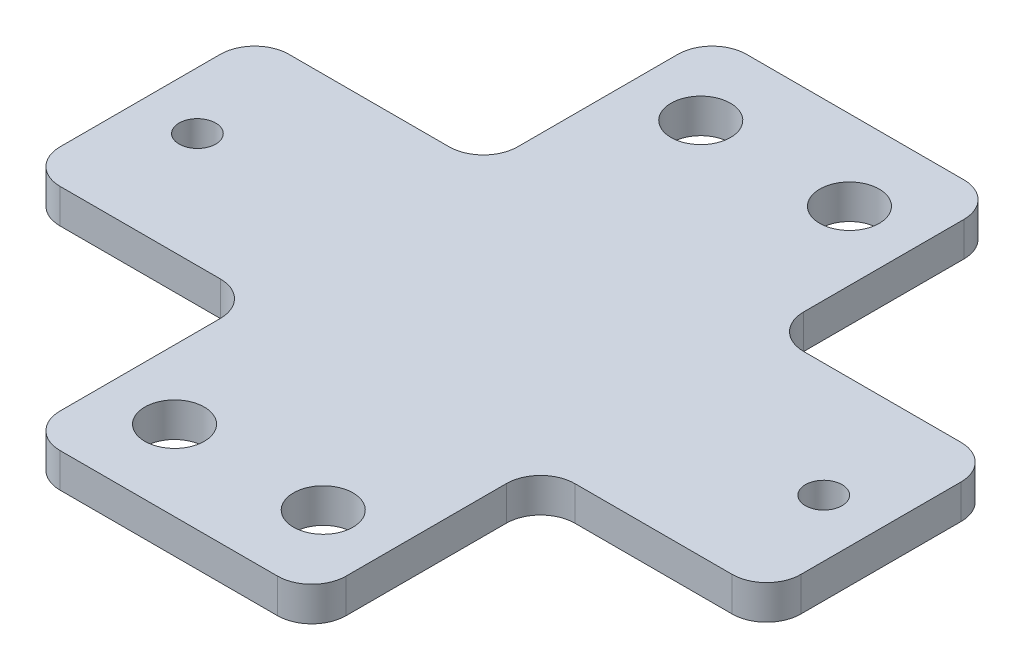
ISO-10303-21;
HEADER;
FILE_DESCRIPTION(('STEP AP214'),'2;1');
FILE_NAME('part.step','',(''),(''),'','','');
FILE_SCHEMA(('AUTOMOTIVE_DESIGN { 1 0 10303 214 1 1 1 1 }'));
ENDSEC;
DATA;
#1=APPLICATION_CONTEXT('core data for automotive mechanical design processes');
#2=APPLICATION_PROTOCOL_DEFINITION('international standard','automotive_design',2000,#1);
#3=PRODUCT_CONTEXT('',#1,'mechanical');
#4=PRODUCT('Part','Part','',(#3));
#5=PRODUCT_RELATED_PRODUCT_CATEGORY('part','',(#4));
#6=PRODUCT_DEFINITION_FORMATION('','',#4);
#7=PRODUCT_DEFINITION_CONTEXT('part definition',#1,'design');
#8=PRODUCT_DEFINITION('design','',#6,#7);
#9=PRODUCT_DEFINITION_SHAPE('','',#8);
#10=(LENGTH_UNIT() NAMED_UNIT(*) SI_UNIT(.MILLI.,.METRE.));
#11=(NAMED_UNIT(*) PLANE_ANGLE_UNIT() SI_UNIT($,.RADIAN.));
#12=(NAMED_UNIT(*) SI_UNIT($,.STERADIAN.) SOLID_ANGLE_UNIT());
#13=UNCERTAINTY_MEASURE_WITH_UNIT(LENGTH_MEASURE(1.E-05),#10,'distance_accuracy_value','');
#14=(GEOMETRIC_REPRESENTATION_CONTEXT(3) GLOBAL_UNCERTAINTY_ASSIGNED_CONTEXT((#13)) GLOBAL_UNIT_ASSIGNED_CONTEXT((#10,
#11,#12)) REPRESENTATION_CONTEXT('',''));
#15=CARTESIAN_POINT('',(0.,0.,0.));
#16=DIRECTION('',(0.,0.,1.));
#17=DIRECTION('',(1.,0.,0.));
#18=AXIS2_PLACEMENT_3D('',#15,#16,#17);
#19=CARTESIAN_POINT('',(25.,3.,0.));
#20=DIRECTION('',(-1.,0.,0.));
#21=DIRECTION('',(0.,0.,1.));
#22=AXIS2_PLACEMENT_3D('',#19,#20,#21);
#23=PLANE('',#22);
#24=DIRECTION('',(0.,0.,-1.));
#25=VECTOR('',#24,1.);
#26=CARTESIAN_POINT('',(25.,3.,0.));
#27=LINE('',#26,#25);
#28=CARTESIAN_POINT('',(25.,3.,-43.));
#29=VERTEX_POINT('',#28);
#30=CARTESIAN_POINT('',(25.,3.,-57.));
#31=VERTEX_POINT('',#30);
#32=EDGE_CURVE('E396',#29,#31,#27,.T.);
#33=ORIENTED_EDGE('',*,*,#32,.F.);
#34=DIRECTION('',(0.,1.,0.));
#35=VECTOR('',#34,1.);
#36=CARTESIAN_POINT('',(25.,3.,-43.));
#37=LINE('',#36,#35);
#38=CARTESIAN_POINT('',(25.,0.,-43.));
#39=VERTEX_POINT('',#38);
#40=EDGE_CURVE('E281',#29,#39,#37,.F.);
#41=ORIENTED_EDGE('',*,*,#40,.T.);
#42=DIRECTION('',(0.,0.,-1.));
#43=VECTOR('',#42,1.);
#44=CARTESIAN_POINT('',(25.,0.,0.));
#45=LINE('',#44,#43);
#46=CARTESIAN_POINT('',(25.,0.,-57.));
#47=VERTEX_POINT('',#46);
#48=EDGE_CURVE('E226',#39,#47,#45,.T.);
#49=ORIENTED_EDGE('',*,*,#48,.T.);
#50=DIRECTION('',(0.,-1.,0.));
#51=VECTOR('',#50,1.);
#52=CARTESIAN_POINT('',(25.,3.,-57.));
#53=LINE('',#52,#51);
#54=EDGE_CURVE('E279',#47,#31,#53,.F.);
#55=ORIENTED_EDGE('',*,*,#54,.T.);
#56=EDGE_LOOP('',(#33,#41,#49,#55));
#57=FACE_BOUND('',#56,.T.);
#58=ADVANCED_FACE('F34',(#57),#23,.F.);
#59=CARTESIAN_POINT('',(0.,3.,0.));
#60=DIRECTION('',(1.,0.,0.));
#61=DIRECTION('',(0.,0.,-1.));
#62=AXIS2_PLACEMENT_3D('',#59,#60,#61);
#63=PLANE('',#62);
#64=DIRECTION('',(0.,0.,1.));
#65=VECTOR('',#64,1.);
#66=CARTESIAN_POINT('',(0.,3.,0.));
#67=LINE('',#66,#65);
#68=CARTESIAN_POINT('',(0.,3.,-17.));
#69=VERTEX_POINT('',#68);
#70=CARTESIAN_POINT('',(0.,3.,-3.));
#71=VERTEX_POINT('',#70);
#72=EDGE_CURVE('E229',#69,#71,#67,.T.);
#73=ORIENTED_EDGE('',*,*,#72,.F.);
#74=DIRECTION('',(0.,1.,0.));
#75=VECTOR('',#74,1.);
#76=CARTESIAN_POINT('',(0.,3.,-17.));
#77=LINE('',#76,#75);
#78=CARTESIAN_POINT('',(0.,0.,-17.));
#79=VERTEX_POINT('',#78);
#80=EDGE_CURVE('E310',#69,#79,#77,.F.);
#81=ORIENTED_EDGE('',*,*,#80,.T.);
#82=DIRECTION('',(0.,0.,1.));
#83=VECTOR('',#82,1.);
#84=CARTESIAN_POINT('',(0.,0.,0.));
#85=LINE('',#84,#83);
#86=CARTESIAN_POINT('',(0.,0.,-3.));
#87=VERTEX_POINT('',#86);
#88=EDGE_CURVE('E352',#79,#87,#85,.T.);
#89=ORIENTED_EDGE('',*,*,#88,.T.);
#90=DIRECTION('',(0.,-1.,0.));
#91=VECTOR('',#90,1.);
#92=CARTESIAN_POINT('',(0.,3.,-3.));
#93=LINE('',#92,#91);
#94=EDGE_CURVE('E308',#87,#71,#93,.F.);
#95=ORIENTED_EDGE('',*,*,#94,.T.);
#96=EDGE_LOOP('',(#73,#81,#89,#95));
#97=FACE_BOUND('',#96,.T.);
#98=ADVANCED_FACE('F340',(#97),#63,.F.);
#99=CARTESIAN_POINT('',(0.,3.,0.));
#100=DIRECTION('',(0.,-1.,0.));
#101=DIRECTION('',(0.,0.,-1.));
#102=AXIS2_PLACEMENT_3D('',#99,#100,#101);
#103=PLANE('',#102);
#104=DIRECTION('',(1.,0.,0.));
#105=VECTOR('',#104,1.);
#106=CARTESIAN_POINT('',(25.,3.,-20.));
#107=LINE('',#106,#105);
#108=CARTESIAN_POINT('',(28.,3.,-20.));
#109=VERTEX_POINT('',#108);
#110=CARTESIAN_POINT('',(41.75,3.,-20.));
#111=VERTEX_POINT('',#110);
#112=EDGE_CURVE('E412',#109,#111,#107,.T.);
#113=ORIENTED_EDGE('',*,*,#112,.T.);
#114=CARTESIAN_POINT('',(41.75,3.,-23.));
#115=DIRECTION('',(0.,-1.,0.));
#116=DIRECTION('',(0.,0.,-1.));
#117=AXIS2_PLACEMENT_3D('',#114,#115,#116);
#118=CIRCLE('',#117,3.);
#119=CARTESIAN_POINT('',(44.75,3.,-23.));
#120=VERTEX_POINT('',#119);
#121=EDGE_CURVE('E256',#111,#120,#118,.F.);
#122=ORIENTED_EDGE('',*,*,#121,.T.);
#123=DIRECTION('',(0.,0.,-1.));
#124=VECTOR('',#123,1.);
#125=CARTESIAN_POINT('',(44.75,3.,-40.));
#126=LINE('',#125,#124);
#127=CARTESIAN_POINT('',(44.75,3.,-37.));
#128=VERTEX_POINT('',#127);
#129=EDGE_CURVE('E419',#120,#128,#126,.T.);
#130=ORIENTED_EDGE('',*,*,#129,.T.);
#131=CARTESIAN_POINT('',(41.75,3.,-37.));
#132=DIRECTION('',(0.,-1.,0.));
#133=DIRECTION('',(0.,0.,-1.));
#134=AXIS2_PLACEMENT_3D('',#131,#132,#133);
#135=CIRCLE('',#134,3.);
#136=CARTESIAN_POINT('',(41.75,3.,-40.));
#137=VERTEX_POINT('',#136);
#138=EDGE_CURVE('E254',#128,#137,#135,.F.);
#139=ORIENTED_EDGE('',*,*,#138,.T.);
#140=DIRECTION('',(-1.,0.,0.));
#141=VECTOR('',#140,1.);
#142=CARTESIAN_POINT('',(25.,3.,-40.));
#143=LINE('',#142,#141);
#144=CARTESIAN_POINT('',(28.,3.,-40.));
#145=VERTEX_POINT('',#144);
#146=EDGE_CURVE('E363',#137,#145,#143,.T.);
#147=ORIENTED_EDGE('',*,*,#146,.T.);
#148=CARTESIAN_POINT('',(28.,3.,-43.));
#149=DIRECTION('',(0.,-1.,0.));
#150=DIRECTION('',(0.,0.,-1.));
#151=AXIS2_PLACEMENT_3D('',#148,#149,#150);
#152=CIRCLE('',#151,3.);
#153=EDGE_CURVE('E319',#145,#29,#152,.T.);
#154=ORIENTED_EDGE('',*,*,#153,.T.);
#155=ORIENTED_EDGE('',*,*,#32,.T.);
#156=CARTESIAN_POINT('',(22.,3.,-57.));
#157=DIRECTION('',(0.,-1.,0.));
#158=DIRECTION('',(0.,0.,-1.));
#159=AXIS2_PLACEMENT_3D('',#156,#157,#158);
#160=CIRCLE('',#159,3.);
#161=CARTESIAN_POINT('',(22.,3.,-60.));
#162=VERTEX_POINT('',#161);
#163=EDGE_CURVE('E252',#31,#162,#160,.F.);
#164=ORIENTED_EDGE('',*,*,#163,.T.);
#165=DIRECTION('',(-1.,0.,0.));
#166=VECTOR('',#165,1.);
#167=CARTESIAN_POINT('',(0.,3.,-60.));
#168=LINE('',#167,#166);
#169=CARTESIAN_POINT('',(3.,3.,-60.));
#170=VERTEX_POINT('',#169);
#171=EDGE_CURVE('E217',#162,#170,#168,.T.);
#172=ORIENTED_EDGE('',*,*,#171,.T.);
#173=CARTESIAN_POINT('',(3.,3.,-57.));
#174=DIRECTION('',(0.,-1.,0.));
#175=DIRECTION('',(0.,0.,-1.));
#176=AXIS2_PLACEMENT_3D('',#173,#174,#175);
#177=CIRCLE('',#176,3.);
#178=CARTESIAN_POINT('',(0.,3.,-57.));
#179=VERTEX_POINT('',#178);
#180=EDGE_CURVE('E250',#170,#179,#177,.F.);
#181=ORIENTED_EDGE('',*,*,#180,.T.);
#182=CARTESIAN_POINT('',(0.,3.,-43.));
#183=VERTEX_POINT('',#182);
#184=EDGE_CURVE('E344',#179,#183,#67,.T.);
#185=ORIENTED_EDGE('',*,*,#184,.T.);
#186=CARTESIAN_POINT('',(-3.,3.,-43.));
#187=DIRECTION('',(0.,-1.,0.));
#188=DIRECTION('',(0.,0.,-1.));
#189=AXIS2_PLACEMENT_3D('',#186,#187,#188);
#190=CIRCLE('',#189,3.);
#191=CARTESIAN_POINT('',(-3.,3.,-40.));
#192=VERTEX_POINT('',#191);
#193=EDGE_CURVE('E323',#183,#192,#190,.T.);
#194=ORIENTED_EDGE('',*,*,#193,.T.);
#195=DIRECTION('',(-1.,0.,0.));
#196=VECTOR('',#195,1.);
#197=CARTESIAN_POINT('',(0.,3.,-40.));
#198=LINE('',#197,#196);
#199=CARTESIAN_POINT('',(-17.,3.,-40.));
#200=VERTEX_POINT('',#199);
#201=EDGE_CURVE('E503',#192,#200,#198,.T.);
#202=ORIENTED_EDGE('',*,*,#201,.T.);
#203=CARTESIAN_POINT('',(-17.,3.,-37.));
#204=DIRECTION('',(0.,-1.,0.));
#205=DIRECTION('',(0.,0.,-1.));
#206=AXIS2_PLACEMENT_3D('',#203,#204,#205);
#207=CIRCLE('',#206,3.);
#208=CARTESIAN_POINT('',(-20.,3.,-37.));
#209=VERTEX_POINT('',#208);
#210=EDGE_CURVE('E248',#200,#209,#207,.F.);
#211=ORIENTED_EDGE('',*,*,#210,.T.);
#212=DIRECTION('',(0.,0.,1.));
#213=VECTOR('',#212,1.);
#214=CARTESIAN_POINT('',(-20.,3.,-40.));
#215=LINE('',#214,#213);
#216=CARTESIAN_POINT('',(-20.,3.,-23.));
#217=VERTEX_POINT('',#216);
#218=EDGE_CURVE('E500',#209,#217,#215,.T.);
#219=ORIENTED_EDGE('',*,*,#218,.T.);
#220=CARTESIAN_POINT('',(-17.,3.,-23.));
#221=DIRECTION('',(0.,-1.,0.));
#222=DIRECTION('',(0.,0.,-1.));
#223=AXIS2_PLACEMENT_3D('',#220,#221,#222);
#224=CIRCLE('',#223,3.);
#225=CARTESIAN_POINT('',(-17.,3.,-20.));
#226=VERTEX_POINT('',#225);
#227=EDGE_CURVE('E246',#217,#226,#224,.F.);
#228=ORIENTED_EDGE('',*,*,#227,.T.);
#229=DIRECTION('',(1.,0.,0.));
#230=VECTOR('',#229,1.);
#231=CARTESIAN_POINT('',(0.,3.,-20.));
#232=LINE('',#231,#230);
#233=CARTESIAN_POINT('',(-3.,3.,-20.));
#234=VERTEX_POINT('',#233);
#235=EDGE_CURVE('E335',#226,#234,#232,.T.);
#236=ORIENTED_EDGE('',*,*,#235,.T.);
#237=CARTESIAN_POINT('',(-3.,3.,-17.));
#238=DIRECTION('',(0.,-1.,0.));
#239=DIRECTION('',(0.,0.,-1.));
#240=AXIS2_PLACEMENT_3D('',#237,#238,#239);
#241=CIRCLE('',#240,3.);
#242=EDGE_CURVE('E42',#234,#69,#241,.T.);
#243=ORIENTED_EDGE('',*,*,#242,.T.);
#244=ORIENTED_EDGE('',*,*,#72,.T.);
#245=CARTESIAN_POINT('',(3.,3.,-3.));
#246=DIRECTION('',(0.,-1.,0.));
#247=DIRECTION('',(0.,0.,-1.));
#248=AXIS2_PLACEMENT_3D('',#245,#246,#247);
#249=CIRCLE('',#248,3.);
#250=CARTESIAN_POINT('',(3.,3.,0.));
#251=VERTEX_POINT('',#250);
#252=EDGE_CURVE('E244',#71,#251,#249,.F.);
#253=ORIENTED_EDGE('',*,*,#252,.T.);
#254=DIRECTION('',(1.,0.,0.));
#255=VECTOR('',#254,1.);
#256=CARTESIAN_POINT('',(0.,3.,0.));
#257=LINE('',#256,#255);
#258=CARTESIAN_POINT('',(22.,3.,0.));
#259=VERTEX_POINT('',#258);
#260=EDGE_CURVE('E393',#251,#259,#257,.T.);
#261=ORIENTED_EDGE('',*,*,#260,.T.);
#262=CARTESIAN_POINT('',(22.,3.,-3.));
#263=DIRECTION('',(0.,-1.,0.));
#264=DIRECTION('',(0.,0.,-1.));
#265=AXIS2_PLACEMENT_3D('',#262,#263,#264);
#266=CIRCLE('',#265,3.);
#267=CARTESIAN_POINT('',(25.,3.,-3.));
#268=VERTEX_POINT('',#267);
#269=EDGE_CURVE('E242',#259,#268,#266,.F.);
#270=ORIENTED_EDGE('',*,*,#269,.T.);
#271=CARTESIAN_POINT('',(25.,3.,-17.));
#272=VERTEX_POINT('',#271);
#273=EDGE_CURVE('E215',#268,#272,#27,.T.);
#274=ORIENTED_EDGE('',*,*,#273,.T.);
#275=CARTESIAN_POINT('',(28.,3.,-17.));
#276=DIRECTION('',(0.,-1.,0.));
#277=DIRECTION('',(0.,0.,-1.));
#278=AXIS2_PLACEMENT_3D('',#275,#276,#277);
#279=CIRCLE('',#278,3.);
#280=EDGE_CURVE('E316',#272,#109,#279,.T.);
#281=ORIENTED_EDGE('',*,*,#280,.T.);
#282=EDGE_LOOP('',(#113,#122,#130,#139,#147,#154,#155,#164,#172,#181,#185,#194,#202,#211,#219,
#228,#236,#243,#244,#253,#261,#270,#274,#281));
#283=FACE_BOUND('',#282,.T.);
#284=CARTESIAN_POINT('',(6.,3.,-7.));
#285=DIRECTION('',(0.,1.,0.));
#286=DIRECTION('',(0.,0.,1.));
#287=AXIS2_PLACEMENT_3D('',#284,#285,#286);
#288=CIRCLE('',#287,2.6);
#289=CARTESIAN_POINT('',(6.,3.,-4.4));
#290=VERTEX_POINT('',#289);
#291=EDGE_CURVE('E388',#290,#290,#288,.T.);
#292=ORIENTED_EDGE('',*,*,#291,.F.);
#293=EDGE_LOOP('',(#292));
#294=FACE_BOUND('',#293,.T.);
#295=CARTESIAN_POINT('',(19.,3.,-7.));
#296=DIRECTION('',(0.,1.,0.));
#297=DIRECTION('',(0.,0.,-1.));
#298=AXIS2_PLACEMENT_3D('',#295,#296,#297);
#299=CIRCLE('',#298,2.6);
#300=CARTESIAN_POINT('',(19.,3.,-9.6));
#301=VERTEX_POINT('',#300);
#302=EDGE_CURVE('E382',#301,#301,#299,.T.);
#303=ORIENTED_EDGE('',*,*,#302,.F.);
#304=EDGE_LOOP('',(#303));
#305=FACE_BOUND('',#304,.T.);
#306=CARTESIAN_POINT('',(6.,3.,-53.));
#307=DIRECTION('',(0.,1.,0.));
#308=DIRECTION('',(0.,0.,-1.));
#309=AXIS2_PLACEMENT_3D('',#306,#307,#308);
#310=CIRCLE('',#309,2.6);
#311=CARTESIAN_POINT('',(6.,3.,-55.6));
#312=VERTEX_POINT('',#311);
#313=EDGE_CURVE('E376',#312,#312,#310,.T.);
#314=ORIENTED_EDGE('',*,*,#313,.F.);
#315=EDGE_LOOP('',(#314));
#316=FACE_BOUND('',#315,.T.);
#317=CARTESIAN_POINT('',(19.,3.,-53.));
#318=DIRECTION('',(0.,1.,0.));
#319=DIRECTION('',(0.,0.,1.));
#320=AXIS2_PLACEMENT_3D('',#317,#318,#319);
#321=CIRCLE('',#320,2.6);
#322=CARTESIAN_POINT('',(19.,3.,-50.4));
#323=VERTEX_POINT('',#322);
#324=EDGE_CURVE('E368',#323,#323,#321,.T.);
#325=ORIENTED_EDGE('',*,*,#324,.F.);
#326=EDGE_LOOP('',(#325));
#327=FACE_BOUND('',#326,.T.);
#328=CARTESIAN_POINT('',(-15.,3.,-30.));
#329=DIRECTION('',(0.,1.,0.));
#330=DIRECTION('',(0.,0.,1.));
#331=AXIS2_PLACEMENT_3D('',#328,#329,#330);
#332=CIRCLE('',#331,1.6);
#333=CARTESIAN_POINT('',(-15.,3.,-28.4));
#334=VERTEX_POINT('',#333);
#335=EDGE_CURVE('E506',#334,#334,#332,.T.);
#336=ORIENTED_EDGE('',*,*,#335,.F.);
#337=EDGE_LOOP('',(#336));
#338=FACE_BOUND('',#337,.T.);
#339=CARTESIAN_POINT('',(39.75,3.,-30.));
#340=DIRECTION('',(0.,1.,0.));
#341=DIRECTION('',(0.,0.,-1.));
#342=AXIS2_PLACEMENT_3D('',#339,#340,#341);
#343=CIRCLE('',#342,1.6);
#344=CARTESIAN_POINT('',(39.75,3.,-31.6));
#345=VERTEX_POINT('',#344);
#346=EDGE_CURVE('E420',#345,#345,#343,.T.);
#347=ORIENTED_EDGE('',*,*,#346,.F.);
#348=EDGE_LOOP('',(#347));
#349=FACE_BOUND('',#348,.T.);
#350=ADVANCED_FACE('F331',(#283,#294,#305,#316,#327,#338,#349),#103,.F.);
#351=CARTESIAN_POINT('',(0.,0.,0.));
#352=DIRECTION('',(0.,-1.,0.));
#353=DIRECTION('',(0.,0.,-1.));
#354=AXIS2_PLACEMENT_3D('',#351,#352,#353);
#355=PLANE('',#354);
#356=CARTESIAN_POINT('',(6.,0.,-53.));
#357=DIRECTION('',(0.,1.,0.));
#358=DIRECTION('',(0.,0.,-1.));
#359=AXIS2_PLACEMENT_3D('',#356,#357,#358);
#360=CIRCLE('',#359,2.6);
#361=CARTESIAN_POINT('',(6.,0.,-55.6));
#362=VERTEX_POINT('',#361);
#363=EDGE_CURVE('E371',#362,#362,#360,.T.);
#364=ORIENTED_EDGE('',*,*,#363,.T.);
#365=EDGE_LOOP('',(#364));
#366=FACE_BOUND('',#365,.T.);
#367=CARTESIAN_POINT('',(6.,0.,-7.));
#368=DIRECTION('',(0.,1.,0.));
#369=DIRECTION('',(0.,0.,1.));
#370=AXIS2_PLACEMENT_3D('',#367,#368,#369);
#371=CIRCLE('',#370,2.6);
#372=CARTESIAN_POINT('',(6.,0.,-4.4));
#373=VERTEX_POINT('',#372);
#374=EDGE_CURVE('E385',#373,#373,#371,.T.);
#375=ORIENTED_EDGE('',*,*,#374,.T.);
#376=EDGE_LOOP('',(#375));
#377=FACE_BOUND('',#376,.T.);
#378=DIRECTION('',(0.,0.,-1.));
#379=VECTOR('',#378,1.);
#380=CARTESIAN_POINT('',(44.75,0.,-40.));
#381=LINE('',#380,#379);
#382=CARTESIAN_POINT('',(44.75,0.,-23.));
#383=VERTEX_POINT('',#382);
#384=CARTESIAN_POINT('',(44.75,0.,-37.));
#385=VERTEX_POINT('',#384);
#386=EDGE_CURVE('E492',#383,#385,#381,.T.);
#387=ORIENTED_EDGE('',*,*,#386,.F.);
#388=CARTESIAN_POINT('',(41.75,0.,-23.));
#389=DIRECTION('',(0.,-1.,0.));
#390=DIRECTION('',(0.,0.,-1.));
#391=AXIS2_PLACEMENT_3D('',#388,#389,#390);
#392=CIRCLE('',#391,3.);
#393=CARTESIAN_POINT('',(41.75,0.,-20.));
#394=VERTEX_POINT('',#393);
#395=EDGE_CURVE('E272',#383,#394,#392,.T.);
#396=ORIENTED_EDGE('',*,*,#395,.T.);
#397=DIRECTION('',(1.,0.,0.));
#398=VECTOR('',#397,1.);
#399=CARTESIAN_POINT('',(25.,0.,-20.));
#400=LINE('',#399,#398);
#401=CARTESIAN_POINT('',(28.,0.,-20.));
#402=VERTEX_POINT('',#401);
#403=EDGE_CURVE('E495',#402,#394,#400,.T.);
#404=ORIENTED_EDGE('',*,*,#403,.F.);
#405=CARTESIAN_POINT('',(28.,0.,-17.));
#406=DIRECTION('',(0.,-1.,0.));
#407=DIRECTION('',(0.,0.,-1.));
#408=AXIS2_PLACEMENT_3D('',#405,#406,#407);
#409=CIRCLE('',#408,3.);
#410=CARTESIAN_POINT('',(25.,0.,-17.));
#411=VERTEX_POINT('',#410);
#412=EDGE_CURVE('E224',#402,#411,#409,.F.);
#413=ORIENTED_EDGE('',*,*,#412,.T.);
#414=CARTESIAN_POINT('',(25.,0.,-3.));
#415=VERTEX_POINT('',#414);
#416=EDGE_CURVE('E212',#415,#411,#45,.T.);
#417=ORIENTED_EDGE('',*,*,#416,.F.);
#418=CARTESIAN_POINT('',(22.,0.,-3.));
#419=DIRECTION('',(0.,-1.,0.));
#420=DIRECTION('',(0.,0.,-1.));
#421=AXIS2_PLACEMENT_3D('',#418,#419,#420);
#422=CIRCLE('',#421,3.);
#423=CARTESIAN_POINT('',(22.,0.,0.));
#424=VERTEX_POINT('',#423);
#425=EDGE_CURVE('E196',#415,#424,#422,.T.);
#426=ORIENTED_EDGE('',*,*,#425,.T.);
#427=DIRECTION('',(1.,0.,0.));
#428=VECTOR('',#427,1.);
#429=CARTESIAN_POINT('',(0.,0.,0.));
#430=LINE('',#429,#428);
#431=CARTESIAN_POINT('',(3.,0.,0.));
#432=VERTEX_POINT('',#431);
#433=EDGE_CURVE('E232',#432,#424,#430,.T.);
#434=ORIENTED_EDGE('',*,*,#433,.F.);
#435=CARTESIAN_POINT('',(3.,0.,-3.));
#436=DIRECTION('',(0.,-1.,0.));
#437=DIRECTION('',(0.,0.,-1.));
#438=AXIS2_PLACEMENT_3D('',#435,#436,#437);
#439=CIRCLE('',#438,3.);
#440=EDGE_CURVE('E204',#432,#87,#439,.T.);
#441=ORIENTED_EDGE('',*,*,#440,.T.);
#442=ORIENTED_EDGE('',*,*,#88,.F.);
#443=CARTESIAN_POINT('',(-3.,0.,-17.));
#444=DIRECTION('',(0.,-1.,0.));
#445=DIRECTION('',(0.,0.,-1.));
#446=AXIS2_PLACEMENT_3D('',#443,#444,#445);
#447=CIRCLE('',#446,3.);
#448=CARTESIAN_POINT('',(-3.,0.,-20.));
#449=VERTEX_POINT('',#448);
#450=EDGE_CURVE('E11',#79,#449,#447,.F.);
#451=ORIENTED_EDGE('',*,*,#450,.T.);
#452=DIRECTION('',(1.,0.,0.));
#453=VECTOR('',#452,1.);
#454=CARTESIAN_POINT('',(0.,0.,-20.));
#455=LINE('',#454,#453);
#456=CARTESIAN_POINT('',(-17.,0.,-20.));
#457=VERTEX_POINT('',#456);
#458=EDGE_CURVE('E350',#457,#449,#455,.T.);
#459=ORIENTED_EDGE('',*,*,#458,.F.);
#460=CARTESIAN_POINT('',(-17.,0.,-23.));
#461=DIRECTION('',(0.,-1.,0.));
#462=DIRECTION('',(0.,0.,-1.));
#463=AXIS2_PLACEMENT_3D('',#460,#461,#462);
#464=CIRCLE('',#463,3.);
#465=CARTESIAN_POINT('',(-20.,0.,-23.));
#466=VERTEX_POINT('',#465);
#467=EDGE_CURVE('E263',#457,#466,#464,.T.);
#468=ORIENTED_EDGE('',*,*,#467,.T.);
#469=DIRECTION('',(0.,0.,1.));
#470=VECTOR('',#469,1.);
#471=CARTESIAN_POINT('',(-20.,0.,-40.));
#472=LINE('',#471,#470);
#473=CARTESIAN_POINT('',(-20.,0.,-37.));
#474=VERTEX_POINT('',#473);
#475=EDGE_CURVE('E356',#474,#466,#472,.T.);
#476=ORIENTED_EDGE('',*,*,#475,.F.);
#477=CARTESIAN_POINT('',(-17.,0.,-37.));
#478=DIRECTION('',(0.,-1.,0.));
#479=DIRECTION('',(0.,0.,-1.));
#480=AXIS2_PLACEMENT_3D('',#477,#478,#479);
#481=CIRCLE('',#480,3.);
#482=CARTESIAN_POINT('',(-17.,0.,-40.));
#483=VERTEX_POINT('',#482);
#484=EDGE_CURVE('E49',#474,#483,#481,.T.);
#485=ORIENTED_EDGE('',*,*,#484,.T.);
#486=DIRECTION('',(-1.,0.,0.));
#487=VECTOR('',#486,1.);
#488=CARTESIAN_POINT('',(0.,0.,-40.));
#489=LINE('',#488,#487);
#490=CARTESIAN_POINT('',(-3.,0.,-40.));
#491=VERTEX_POINT('',#490);
#492=EDGE_CURVE('E360',#491,#483,#489,.T.);
#493=ORIENTED_EDGE('',*,*,#492,.F.);
#494=CARTESIAN_POINT('',(-3.,0.,-43.));
#495=DIRECTION('',(0.,-1.,0.));
#496=DIRECTION('',(0.,0.,-1.));
#497=AXIS2_PLACEMENT_3D('',#494,#495,#496);
#498=CIRCLE('',#497,3.);
#499=CARTESIAN_POINT('',(0.,0.,-43.));
#500=VERTEX_POINT('',#499);
#501=EDGE_CURVE('E325',#491,#500,#498,.F.);
#502=ORIENTED_EDGE('',*,*,#501,.T.);
#503=CARTESIAN_POINT('',(0.,0.,-57.));
#504=VERTEX_POINT('',#503);
#505=EDGE_CURVE('E400',#504,#500,#85,.T.);
#506=ORIENTED_EDGE('',*,*,#505,.F.);
#507=CARTESIAN_POINT('',(3.,0.,-57.));
#508=DIRECTION('',(0.,-1.,0.));
#509=DIRECTION('',(0.,0.,-1.));
#510=AXIS2_PLACEMENT_3D('',#507,#508,#509);
#511=CIRCLE('',#510,3.);
#512=CARTESIAN_POINT('',(3.,0.,-60.));
#513=VERTEX_POINT('',#512);
#514=EDGE_CURVE('E266',#504,#513,#511,.T.);
#515=ORIENTED_EDGE('',*,*,#514,.T.);
#516=DIRECTION('',(-1.,0.,0.));
#517=VECTOR('',#516,1.);
#518=CARTESIAN_POINT('',(0.,0.,-60.));
#519=LINE('',#518,#517);
#520=CARTESIAN_POINT('',(22.,0.,-60.));
#521=VERTEX_POINT('',#520);
#522=EDGE_CURVE('E225',#521,#513,#519,.T.);
#523=ORIENTED_EDGE('',*,*,#522,.F.);
#524=CARTESIAN_POINT('',(22.,0.,-57.));
#525=DIRECTION('',(0.,-1.,0.));
#526=DIRECTION('',(0.,0.,-1.));
#527=AXIS2_PLACEMENT_3D('',#524,#525,#526);
#528=CIRCLE('',#527,3.);
#529=EDGE_CURVE('E268',#521,#47,#528,.T.);
#530=ORIENTED_EDGE('',*,*,#529,.T.);
#531=ORIENTED_EDGE('',*,*,#48,.F.);
#532=CARTESIAN_POINT('',(28.,0.,-43.));
#533=DIRECTION('',(0.,-1.,0.));
#534=DIRECTION('',(0.,0.,-1.));
#535=AXIS2_PLACEMENT_3D('',#532,#533,#534);
#536=CIRCLE('',#535,3.);
#537=CARTESIAN_POINT('',(28.,0.,-40.));
#538=VERTEX_POINT('',#537);
#539=EDGE_CURVE('E321',#39,#538,#536,.F.);
#540=ORIENTED_EDGE('',*,*,#539,.T.);
#541=DIRECTION('',(-1.,0.,0.));
#542=VECTOR('',#541,1.);
#543=CARTESIAN_POINT('',(25.,0.,-40.));
#544=LINE('',#543,#542);
#545=CARTESIAN_POINT('',(41.75,0.,-40.));
#546=VERTEX_POINT('',#545);
#547=EDGE_CURVE('E485',#546,#538,#544,.T.);
#548=ORIENTED_EDGE('',*,*,#547,.F.);
#549=CARTESIAN_POINT('',(41.75,0.,-37.));
#550=DIRECTION('',(0.,-1.,0.));
#551=DIRECTION('',(0.,0.,-1.));
#552=AXIS2_PLACEMENT_3D('',#549,#550,#551);
#553=CIRCLE('',#552,3.);
#554=EDGE_CURVE('E270',#546,#385,#553,.T.);
#555=ORIENTED_EDGE('',*,*,#554,.T.);
#556=EDGE_LOOP('',(#387,#396,#404,#413,#417,#426,#434,#441,#442,#451,#459,#468,#476,#485,#493,
#502,#506,#515,#523,#530,#531,#540,#548,#555));
#557=FACE_BOUND('',#556,.T.);
#558=CARTESIAN_POINT('',(19.,0.,-7.));
#559=DIRECTION('',(0.,1.,0.));
#560=DIRECTION('',(0.,0.,-1.));
#561=AXIS2_PLACEMENT_3D('',#558,#559,#560);
#562=CIRCLE('',#561,2.6);
#563=CARTESIAN_POINT('',(19.,0.,-9.6));
#564=VERTEX_POINT('',#563);
#565=EDGE_CURVE('E379',#564,#564,#562,.T.);
#566=ORIENTED_EDGE('',*,*,#565,.T.);
#567=EDGE_LOOP('',(#566));
#568=FACE_BOUND('',#567,.T.);
#569=CARTESIAN_POINT('',(19.,0.,-53.));
#570=DIRECTION('',(0.,1.,0.));
#571=DIRECTION('',(0.,0.,1.));
#572=AXIS2_PLACEMENT_3D('',#569,#570,#571);
#573=CIRCLE('',#572,2.6);
#574=CARTESIAN_POINT('',(19.,0.,-50.4));
#575=VERTEX_POINT('',#574);
#576=EDGE_CURVE('E372',#575,#575,#573,.T.);
#577=ORIENTED_EDGE('',*,*,#576,.T.);
#578=EDGE_LOOP('',(#577));
#579=FACE_BOUND('',#578,.T.);
#580=CARTESIAN_POINT('',(-15.,0.,-30.));
#581=DIRECTION('',(0.,-1.,0.));
#582=DIRECTION('',(0.,0.,-1.));
#583=AXIS2_PLACEMENT_3D('',#580,#581,#582);
#584=CIRCLE('',#583,1.6);
#585=CARTESIAN_POINT('',(-15.,0.,-31.6));
#586=VERTEX_POINT('',#585);
#587=EDGE_CURVE('E375',#586,#586,#584,.F.);
#588=ORIENTED_EDGE('',*,*,#587,.T.);
#589=EDGE_LOOP('',(#588));
#590=FACE_BOUND('',#589,.T.);
#591=CARTESIAN_POINT('',(39.75,0.,-30.));
#592=DIRECTION('',(0.,-1.,0.));
#593=DIRECTION('',(0.,0.,-1.));
#594=AXIS2_PLACEMENT_3D('',#591,#592,#593);
#595=CIRCLE('',#594,1.6);
#596=CARTESIAN_POINT('',(39.75,0.,-31.6));
#597=VERTEX_POINT('',#596);
#598=EDGE_CURVE('E357',#597,#597,#595,.F.);
#599=ORIENTED_EDGE('',*,*,#598,.T.);
#600=EDGE_LOOP('',(#599));
#601=FACE_BOUND('',#600,.T.);
#602=ADVANCED_FACE('F220',(#366,#377,#557,#568,#579,#590,#601),#355,.T.);
#603=ORIENTED_EDGE('',*,*,#184,.F.);
#604=DIRECTION('',(0.,-1.,0.));
#605=VECTOR('',#604,1.);
#606=CARTESIAN_POINT('',(0.,3.,-57.));
#607=LINE('',#606,#605);
#608=EDGE_CURVE('E291',#179,#504,#607,.T.);
#609=ORIENTED_EDGE('',*,*,#608,.T.);
#610=ORIENTED_EDGE('',*,*,#505,.T.);
#611=DIRECTION('',(0.,1.,0.));
#612=VECTOR('',#611,1.);
#613=CARTESIAN_POINT('',(0.,3.,-43.));
#614=LINE('',#613,#612);
#615=EDGE_CURVE('E288',#500,#183,#614,.T.);
#616=ORIENTED_EDGE('',*,*,#615,.T.);
#617=EDGE_LOOP('',(#603,#609,#610,#616));
#618=FACE_BOUND('',#617,.T.);
#619=ADVANCED_FACE('F443',(#618),#63,.F.);
#620=CARTESIAN_POINT('',(0.,3.,0.));
#621=DIRECTION('',(0.,0.,-1.));
#622=DIRECTION('',(-1.,0.,0.));
#623=AXIS2_PLACEMENT_3D('',#620,#621,#622);
#624=PLANE('',#623);
#625=ORIENTED_EDGE('',*,*,#260,.F.);
#626=DIRECTION('',(0.,-1.,0.));
#627=VECTOR('',#626,1.);
#628=CARTESIAN_POINT('',(3.,3.,0.));
#629=LINE('',#628,#627);
#630=EDGE_CURVE('E313',#251,#432,#629,.T.);
#631=ORIENTED_EDGE('',*,*,#630,.T.);
#632=ORIENTED_EDGE('',*,*,#433,.T.);
#633=DIRECTION('',(0.,-1.,0.));
#634=VECTOR('',#633,1.);
#635=CARTESIAN_POINT('',(22.,3.,0.));
#636=LINE('',#635,#634);
#637=EDGE_CURVE('E200',#424,#259,#636,.F.);
#638=ORIENTED_EDGE('',*,*,#637,.T.);
#639=EDGE_LOOP('',(#625,#631,#632,#638));
#640=FACE_BOUND('',#639,.T.);
#641=ADVANCED_FACE('F407',(#640),#624,.F.);
#642=ORIENTED_EDGE('',*,*,#416,.T.);
#643=DIRECTION('',(0.,1.,0.));
#644=VECTOR('',#643,1.);
#645=CARTESIAN_POINT('',(25.,3.,-17.));
#646=LINE('',#645,#644);
#647=EDGE_CURVE('E216',#411,#272,#646,.T.);
#648=ORIENTED_EDGE('',*,*,#647,.T.);
#649=ORIENTED_EDGE('',*,*,#273,.F.);
#650=DIRECTION('',(0.,-1.,0.));
#651=VECTOR('',#650,1.);
#652=CARTESIAN_POINT('',(25.,3.,-3.));
#653=LINE('',#652,#651);
#654=EDGE_CURVE('E199',#268,#415,#653,.T.);
#655=ORIENTED_EDGE('',*,*,#654,.T.);
#656=EDGE_LOOP('',(#642,#648,#649,#655));
#657=FACE_BOUND('',#656,.T.);
#658=ADVANCED_FACE('F210',(#657),#23,.F.);
#659=CARTESIAN_POINT('',(0.,3.,-60.));
#660=DIRECTION('',(0.,0.,1.));
#661=DIRECTION('',(1.,0.,0.));
#662=AXIS2_PLACEMENT_3D('',#659,#660,#661);
#663=PLANE('',#662);
#664=ORIENTED_EDGE('',*,*,#171,.F.);
#665=DIRECTION('',(0.,-1.,0.));
#666=VECTOR('',#665,1.);
#667=CARTESIAN_POINT('',(22.,3.,-60.));
#668=LINE('',#667,#666);
#669=EDGE_CURVE('E285',#162,#521,#668,.T.);
#670=ORIENTED_EDGE('',*,*,#669,.T.);
#671=ORIENTED_EDGE('',*,*,#522,.T.);
#672=DIRECTION('',(0.,-1.,0.));
#673=VECTOR('',#672,1.);
#674=CARTESIAN_POINT('',(3.,3.,-60.));
#675=LINE('',#674,#673);
#676=EDGE_CURVE('E283',#513,#170,#675,.F.);
#677=ORIENTED_EDGE('',*,*,#676,.T.);
#678=EDGE_LOOP('',(#664,#670,#671,#677));
#679=FACE_BOUND('',#678,.T.);
#680=ADVANCED_FACE('F448',(#679),#663,.F.);
#681=CARTESIAN_POINT('',(6.,3.,-7.));
#682=DIRECTION('',(0.,-1.,0.));
#683=DIRECTION('',(0.,0.,-1.));
#684=AXIS2_PLACEMENT_3D('',#681,#682,#683);
#685=CYLINDRICAL_SURFACE('',#684,2.6);
#686=ORIENTED_EDGE('',*,*,#291,.T.);
#687=EDGE_LOOP('',(#686));
#688=FACE_BOUND('',#687,.T.);
#689=ORIENTED_EDGE('',*,*,#374,.F.);
#690=EDGE_LOOP('',(#689));
#691=FACE_BOUND('',#690,.T.);
#692=ADVANCED_FACE('F453',(#688,#691),#685,.F.);
#693=CARTESIAN_POINT('',(19.,3.,-7.));
#694=DIRECTION('',(0.,-1.,0.));
#695=DIRECTION('',(0.,0.,-1.));
#696=AXIS2_PLACEMENT_3D('',#693,#694,#695);
#697=CYLINDRICAL_SURFACE('',#696,2.6);
#698=ORIENTED_EDGE('',*,*,#302,.T.);
#699=EDGE_LOOP('',(#698));
#700=FACE_BOUND('',#699,.T.);
#701=ORIENTED_EDGE('',*,*,#565,.F.);
#702=EDGE_LOOP('',(#701));
#703=FACE_BOUND('',#702,.T.);
#704=ADVANCED_FACE('F536',(#700,#703),#697,.F.);
#705=CARTESIAN_POINT('',(6.,3.,-53.));
#706=DIRECTION('',(0.,-1.,0.));
#707=DIRECTION('',(0.,0.,-1.));
#708=AXIS2_PLACEMENT_3D('',#705,#706,#707);
#709=CYLINDRICAL_SURFACE('',#708,2.6);
#710=ORIENTED_EDGE('',*,*,#313,.T.);
#711=EDGE_LOOP('',(#710));
#712=FACE_BOUND('',#711,.T.);
#713=ORIENTED_EDGE('',*,*,#363,.F.);
#714=EDGE_LOOP('',(#713));
#715=FACE_BOUND('',#714,.T.);
#716=ADVANCED_FACE('F532',(#712,#715),#709,.F.);
#717=CARTESIAN_POINT('',(19.,3.,-53.));
#718=DIRECTION('',(0.,-1.,0.));
#719=DIRECTION('',(0.,0.,-1.));
#720=AXIS2_PLACEMENT_3D('',#717,#718,#719);
#721=CYLINDRICAL_SURFACE('',#720,2.6);
#722=ORIENTED_EDGE('',*,*,#324,.T.);
#723=EDGE_LOOP('',(#722));
#724=FACE_BOUND('',#723,.T.);
#725=ORIENTED_EDGE('',*,*,#576,.F.);
#726=EDGE_LOOP('',(#725));
#727=FACE_BOUND('',#726,.T.);
#728=ADVANCED_FACE('F529',(#724,#727),#721,.F.);
#729=CARTESIAN_POINT('',(0.,-28.2842712474619,-20.));
#730=DIRECTION('',(0.,0.,1.));
#731=DIRECTION('',(1.,0.,0.));
#732=AXIS2_PLACEMENT_3D('',#729,#730,#731);
#733=PLANE('',#732);
#734=ORIENTED_EDGE('',*,*,#235,.F.);
#735=DIRECTION('',(0.,1.,0.));
#736=VECTOR('',#735,1.);
#737=CARTESIAN_POINT('',(-17.,-28.2842712474619,-20.));
#738=LINE('',#737,#736);
#739=EDGE_CURVE('E306',#226,#457,#738,.F.);
#740=ORIENTED_EDGE('',*,*,#739,.T.);
#741=ORIENTED_EDGE('',*,*,#458,.T.);
#742=DIRECTION('',(0.,1.,0.));
#743=VECTOR('',#742,1.);
#744=CARTESIAN_POINT('',(-3.,-28.2842712474619,-20.));
#745=LINE('',#744,#743);
#746=EDGE_CURVE('E303',#449,#234,#745,.T.);
#747=ORIENTED_EDGE('',*,*,#746,.T.);
#748=EDGE_LOOP('',(#734,#740,#741,#747));
#749=FACE_BOUND('',#748,.T.);
#750=ADVANCED_FACE('F354',(#749),#733,.T.);
#751=CARTESIAN_POINT('',(-20.,-28.2842712474619,-40.));
#752=DIRECTION('',(-1.,0.,0.));
#753=DIRECTION('',(0.,0.,1.));
#754=AXIS2_PLACEMENT_3D('',#751,#752,#753);
#755=PLANE('',#754);
#756=ORIENTED_EDGE('',*,*,#218,.F.);
#757=DIRECTION('',(0.,1.,0.));
#758=VECTOR('',#757,1.);
#759=CARTESIAN_POINT('',(-20.,-28.2842712474619,-37.));
#760=LINE('',#759,#758);
#761=EDGE_CURVE('E301',#209,#474,#760,.F.);
#762=ORIENTED_EDGE('',*,*,#761,.T.);
#763=ORIENTED_EDGE('',*,*,#475,.T.);
#764=DIRECTION('',(0.,1.,0.));
#765=VECTOR('',#764,1.);
#766=CARTESIAN_POINT('',(-20.,-28.2842712474619,-23.));
#767=LINE('',#766,#765);
#768=EDGE_CURVE('E298',#466,#217,#767,.T.);
#769=ORIENTED_EDGE('',*,*,#768,.T.);
#770=EDGE_LOOP('',(#756,#762,#763,#769));
#771=FACE_BOUND('',#770,.T.);
#772=ADVANCED_FACE('F524',(#771),#755,.T.);
#773=CARTESIAN_POINT('',(0.,-28.2842712474619,-40.));
#774=DIRECTION('',(0.,0.,-1.));
#775=DIRECTION('',(-1.,0.,0.));
#776=AXIS2_PLACEMENT_3D('',#773,#774,#775);
#777=PLANE('',#776);
#778=ORIENTED_EDGE('',*,*,#201,.F.);
#779=DIRECTION('',(0.,1.,0.));
#780=VECTOR('',#779,1.);
#781=CARTESIAN_POINT('',(-3.,-28.2842712474619,-40.));
#782=LINE('',#781,#780);
#783=EDGE_CURVE('E56',#192,#491,#782,.F.);
#784=ORIENTED_EDGE('',*,*,#783,.T.);
#785=ORIENTED_EDGE('',*,*,#492,.T.);
#786=DIRECTION('',(0.,1.,0.));
#787=VECTOR('',#786,1.);
#788=CARTESIAN_POINT('',(-17.,-28.2842712474619,-40.));
#789=LINE('',#788,#787);
#790=EDGE_CURVE('E294',#483,#200,#789,.T.);
#791=ORIENTED_EDGE('',*,*,#790,.T.);
#792=EDGE_LOOP('',(#778,#784,#785,#791));
#793=FACE_BOUND('',#792,.T.);
#794=ADVANCED_FACE('F515',(#793),#777,.T.);
#795=CARTESIAN_POINT('',(-15.,-28.2842712474619,-30.));
#796=DIRECTION('',(0.,1.,0.));
#797=DIRECTION('',(0.,0.,1.));
#798=AXIS2_PLACEMENT_3D('',#795,#796,#797);
#799=CYLINDRICAL_SURFACE('',#798,1.6);
#800=ORIENTED_EDGE('',*,*,#335,.T.);
#801=EDGE_LOOP('',(#800));
#802=FACE_BOUND('',#801,.T.);
#803=ORIENTED_EDGE('',*,*,#587,.F.);
#804=EDGE_LOOP('',(#803));
#805=FACE_BOUND('',#804,.T.);
#806=ADVANCED_FACE('F513',(#802,#805),#799,.F.);
#807=CARTESIAN_POINT('',(25.,-28.2842712474619,-40.));
#808=DIRECTION('',(0.,0.,-1.));
#809=DIRECTION('',(-1.,0.,0.));
#810=AXIS2_PLACEMENT_3D('',#807,#808,#809);
#811=PLANE('',#810);
#812=ORIENTED_EDGE('',*,*,#146,.F.);
#813=DIRECTION('',(0.,1.,0.));
#814=VECTOR('',#813,1.);
#815=CARTESIAN_POINT('',(41.75,-28.2842712474619,-40.));
#816=LINE('',#815,#814);
#817=EDGE_CURVE('E277',#137,#546,#816,.F.);
#818=ORIENTED_EDGE('',*,*,#817,.T.);
#819=ORIENTED_EDGE('',*,*,#547,.T.);
#820=DIRECTION('',(0.,1.,0.));
#821=VECTOR('',#820,1.);
#822=CARTESIAN_POINT('',(28.,-28.2842712474619,-40.));
#823=LINE('',#822,#821);
#824=EDGE_CURVE('E274',#538,#145,#823,.T.);
#825=ORIENTED_EDGE('',*,*,#824,.T.);
#826=EDGE_LOOP('',(#812,#818,#819,#825));
#827=FACE_BOUND('',#826,.T.);
#828=ADVANCED_FACE('F489',(#827),#811,.T.);
#829=CARTESIAN_POINT('',(44.75,-28.2842712474619,-40.));
#830=DIRECTION('',(1.,0.,0.));
#831=DIRECTION('',(0.,0.,-1.));
#832=AXIS2_PLACEMENT_3D('',#829,#830,#831);
#833=PLANE('',#832);
#834=ORIENTED_EDGE('',*,*,#129,.F.);
#835=DIRECTION('',(0.,1.,0.));
#836=VECTOR('',#835,1.);
#837=CARTESIAN_POINT('',(44.75,-28.2842712474619,-23.));
#838=LINE('',#837,#836);
#839=EDGE_CURVE('E205',#120,#383,#838,.F.);
#840=ORIENTED_EDGE('',*,*,#839,.T.);
#841=ORIENTED_EDGE('',*,*,#386,.T.);
#842=DIRECTION('',(0.,1.,0.));
#843=VECTOR('',#842,1.);
#844=CARTESIAN_POINT('',(44.75,-28.2842712474619,-37.));
#845=LINE('',#844,#843);
#846=EDGE_CURVE('E258',#385,#128,#845,.T.);
#847=ORIENTED_EDGE('',*,*,#846,.T.);
#848=EDGE_LOOP('',(#834,#840,#841,#847));
#849=FACE_BOUND('',#848,.T.);
#850=ADVANCED_FACE('F522',(#849),#833,.T.);
#851=CARTESIAN_POINT('',(25.,-28.2842712474619,-20.));
#852=DIRECTION('',(0.,0.,1.));
#853=DIRECTION('',(1.,0.,0.));
#854=AXIS2_PLACEMENT_3D('',#851,#852,#853);
#855=PLANE('',#854);
#856=ORIENTED_EDGE('',*,*,#112,.F.);
#857=DIRECTION('',(0.,1.,0.));
#858=VECTOR('',#857,1.);
#859=CARTESIAN_POINT('',(28.,-28.2842712474619,-20.));
#860=LINE('',#859,#858);
#861=EDGE_CURVE('E240',#109,#402,#860,.F.);
#862=ORIENTED_EDGE('',*,*,#861,.T.);
#863=ORIENTED_EDGE('',*,*,#403,.T.);
#864=DIRECTION('',(0.,1.,0.));
#865=VECTOR('',#864,1.);
#866=CARTESIAN_POINT('',(41.75,-28.2842712474619,-20.));
#867=LINE('',#866,#865);
#868=EDGE_CURVE('E237',#394,#111,#867,.T.);
#869=ORIENTED_EDGE('',*,*,#868,.T.);
#870=EDGE_LOOP('',(#856,#862,#863,#869));
#871=FACE_BOUND('',#870,.T.);
#872=ADVANCED_FACE('F416',(#871),#855,.T.);
#873=CARTESIAN_POINT('',(39.75,-28.2842712474619,-30.));
#874=DIRECTION('',(0.,1.,0.));
#875=DIRECTION('',(0.,0.,1.));
#876=AXIS2_PLACEMENT_3D('',#873,#874,#875);
#877=CYLINDRICAL_SURFACE('',#876,1.6);
#878=ORIENTED_EDGE('',*,*,#346,.T.);
#879=EDGE_LOOP('',(#878));
#880=FACE_BOUND('',#879,.T.);
#881=ORIENTED_EDGE('',*,*,#598,.F.);
#882=EDGE_LOOP('',(#881));
#883=FACE_BOUND('',#882,.T.);
#884=ADVANCED_FACE('F425',(#880,#883),#877,.F.);
#885=CARTESIAN_POINT('',(28.,3.,-17.));
#886=DIRECTION('',(0.,1.,0.));
#887=DIRECTION('',(0.,0.,1.));
#888=AXIS2_PLACEMENT_3D('',#885,#886,#887);
#889=CYLINDRICAL_SURFACE('',#888,3.);
#890=ORIENTED_EDGE('',*,*,#412,.F.);
#891=ORIENTED_EDGE('',*,*,#861,.F.);
#892=ORIENTED_EDGE('',*,*,#280,.F.);
#893=ORIENTED_EDGE('',*,*,#647,.F.);
#894=EDGE_LOOP('',(#890,#891,#892,#893));
#895=FACE_BOUND('',#894,.T.);
#896=ADVANCED_FACE('F422',(#895),#889,.F.);
#897=CARTESIAN_POINT('',(41.75,-28.2842712474619,-23.));
#898=DIRECTION('',(0.,1.,0.));
#899=DIRECTION('',(0.,0.,1.));
#900=AXIS2_PLACEMENT_3D('',#897,#898,#899);
#901=CYLINDRICAL_SURFACE('',#900,3.);
#902=ORIENTED_EDGE('',*,*,#395,.F.);
#903=ORIENTED_EDGE('',*,*,#839,.F.);
#904=ORIENTED_EDGE('',*,*,#121,.F.);
#905=ORIENTED_EDGE('',*,*,#868,.F.);
#906=EDGE_LOOP('',(#902,#903,#904,#905));
#907=FACE_BOUND('',#906,.T.);
#908=ADVANCED_FACE('F424',(#907),#901,.T.);
#909=CARTESIAN_POINT('',(41.75,-28.2842712474619,-37.));
#910=DIRECTION('',(0.,1.,0.));
#911=DIRECTION('',(0.,0.,1.));
#912=AXIS2_PLACEMENT_3D('',#909,#910,#911);
#913=CYLINDRICAL_SURFACE('',#912,3.);
#914=ORIENTED_EDGE('',*,*,#554,.F.);
#915=ORIENTED_EDGE('',*,*,#817,.F.);
#916=ORIENTED_EDGE('',*,*,#138,.F.);
#917=ORIENTED_EDGE('',*,*,#846,.F.);
#918=EDGE_LOOP('',(#914,#915,#916,#917));
#919=FACE_BOUND('',#918,.T.);
#920=ADVANCED_FACE('F431',(#919),#913,.T.);
#921=CARTESIAN_POINT('',(28.,-28.2842712474619,-43.));
#922=DIRECTION('',(0.,1.,0.));
#923=DIRECTION('',(0.,0.,1.));
#924=AXIS2_PLACEMENT_3D('',#921,#922,#923);
#925=CYLINDRICAL_SURFACE('',#924,3.);
#926=ORIENTED_EDGE('',*,*,#539,.F.);
#927=ORIENTED_EDGE('',*,*,#40,.F.);
#928=ORIENTED_EDGE('',*,*,#153,.F.);
#929=ORIENTED_EDGE('',*,*,#824,.F.);
#930=EDGE_LOOP('',(#926,#927,#928,#929));
#931=FACE_BOUND('',#930,.T.);
#932=ADVANCED_FACE('F481',(#931),#925,.F.);
#933=CARTESIAN_POINT('',(22.,3.,-57.));
#934=DIRECTION('',(0.,-1.,0.));
#935=DIRECTION('',(0.,0.,-1.));
#936=AXIS2_PLACEMENT_3D('',#933,#934,#935);
#937=CYLINDRICAL_SURFACE('',#936,3.);
#938=ORIENTED_EDGE('',*,*,#163,.F.);
#939=ORIENTED_EDGE('',*,*,#54,.F.);
#940=ORIENTED_EDGE('',*,*,#529,.F.);
#941=ORIENTED_EDGE('',*,*,#669,.F.);
#942=EDGE_LOOP('',(#938,#939,#940,#941));
#943=FACE_BOUND('',#942,.T.);
#944=ADVANCED_FACE('F475',(#943),#937,.T.);
#945=CARTESIAN_POINT('',(3.,3.,-57.));
#946=DIRECTION('',(0.,-1.,0.));
#947=DIRECTION('',(0.,0.,-1.));
#948=AXIS2_PLACEMENT_3D('',#945,#946,#947);
#949=CYLINDRICAL_SURFACE('',#948,3.);
#950=ORIENTED_EDGE('',*,*,#180,.F.);
#951=ORIENTED_EDGE('',*,*,#676,.F.);
#952=ORIENTED_EDGE('',*,*,#514,.F.);
#953=ORIENTED_EDGE('',*,*,#608,.F.);
#954=EDGE_LOOP('',(#950,#951,#952,#953));
#955=FACE_BOUND('',#954,.T.);
#956=ADVANCED_FACE('F468',(#955),#949,.T.);
#957=CARTESIAN_POINT('',(-3.,3.,-43.));
#958=DIRECTION('',(0.,1.,0.));
#959=DIRECTION('',(0.,0.,1.));
#960=AXIS2_PLACEMENT_3D('',#957,#958,#959);
#961=CYLINDRICAL_SURFACE('',#960,3.);
#962=ORIENTED_EDGE('',*,*,#501,.F.);
#963=ORIENTED_EDGE('',*,*,#783,.F.);
#964=ORIENTED_EDGE('',*,*,#193,.F.);
#965=ORIENTED_EDGE('',*,*,#615,.F.);
#966=EDGE_LOOP('',(#962,#963,#964,#965));
#967=FACE_BOUND('',#966,.T.);
#968=ADVANCED_FACE('F664',(#967),#961,.F.);
#969=CARTESIAN_POINT('',(-17.,-28.2842712474619,-37.));
#970=DIRECTION('',(0.,1.,0.));
#971=DIRECTION('',(0.,0.,1.));
#972=AXIS2_PLACEMENT_3D('',#969,#970,#971);
#973=CYLINDRICAL_SURFACE('',#972,3.);
#974=ORIENTED_EDGE('',*,*,#484,.F.);
#975=ORIENTED_EDGE('',*,*,#761,.F.);
#976=ORIENTED_EDGE('',*,*,#210,.F.);
#977=ORIENTED_EDGE('',*,*,#790,.F.);
#978=EDGE_LOOP('',(#974,#975,#976,#977));
#979=FACE_BOUND('',#978,.T.);
#980=ADVANCED_FACE('F673',(#979),#973,.T.);
#981=CARTESIAN_POINT('',(-17.,-28.2842712474619,-23.));
#982=DIRECTION('',(0.,1.,0.));
#983=DIRECTION('',(0.,0.,1.));
#984=AXIS2_PLACEMENT_3D('',#981,#982,#983);
#985=CYLINDRICAL_SURFACE('',#984,3.);
#986=ORIENTED_EDGE('',*,*,#467,.F.);
#987=ORIENTED_EDGE('',*,*,#739,.F.);
#988=ORIENTED_EDGE('',*,*,#227,.F.);
#989=ORIENTED_EDGE('',*,*,#768,.F.);
#990=EDGE_LOOP('',(#986,#987,#988,#989));
#991=FACE_BOUND('',#990,.T.);
#992=ADVANCED_FACE('F683',(#991),#985,.T.);
#993=CARTESIAN_POINT('',(-3.,-28.2842712474619,-17.));
#994=DIRECTION('',(0.,1.,0.));
#995=DIRECTION('',(0.,0.,1.));
#996=AXIS2_PLACEMENT_3D('',#993,#994,#995);
#997=CYLINDRICAL_SURFACE('',#996,3.);
#998=ORIENTED_EDGE('',*,*,#450,.F.);
#999=ORIENTED_EDGE('',*,*,#80,.F.);
#1000=ORIENTED_EDGE('',*,*,#242,.F.);
#1001=ORIENTED_EDGE('',*,*,#746,.F.);
#1002=EDGE_LOOP('',(#998,#999,#1000,#1001));
#1003=FACE_BOUND('',#1002,.T.);
#1004=ADVANCED_FACE('F347',(#1003),#997,.F.);
#1005=CARTESIAN_POINT('',(3.,3.,-3.));
#1006=DIRECTION('',(0.,-1.,0.));
#1007=DIRECTION('',(0.,0.,-1.));
#1008=AXIS2_PLACEMENT_3D('',#1005,#1006,#1007);
#1009=CYLINDRICAL_SURFACE('',#1008,3.);
#1010=ORIENTED_EDGE('',*,*,#252,.F.);
#1011=ORIENTED_EDGE('',*,*,#94,.F.);
#1012=ORIENTED_EDGE('',*,*,#440,.F.);
#1013=ORIENTED_EDGE('',*,*,#630,.F.);
#1014=EDGE_LOOP('',(#1010,#1011,#1012,#1013));
#1015=FACE_BOUND('',#1014,.T.);
#1016=ADVANCED_FACE('F410',(#1015),#1009,.T.);
#1017=CARTESIAN_POINT('',(22.,3.,-3.));
#1018=DIRECTION('',(0.,-1.,0.));
#1019=DIRECTION('',(0.,0.,-1.));
#1020=AXIS2_PLACEMENT_3D('',#1017,#1018,#1019);
#1021=CYLINDRICAL_SURFACE('',#1020,3.);
#1022=ORIENTED_EDGE('',*,*,#269,.F.);
#1023=ORIENTED_EDGE('',*,*,#637,.F.);
#1024=ORIENTED_EDGE('',*,*,#425,.F.);
#1025=ORIENTED_EDGE('',*,*,#654,.F.);
#1026=EDGE_LOOP('',(#1022,#1023,#1024,#1025));
#1027=FACE_BOUND('',#1026,.T.);
#1028=ADVANCED_FACE('F36',(#1027),#1021,.T.);
#1029=CLOSED_SHELL('',(#58,#98,#350,#602,#619,#641,#658,#680,#692,#704,#716,#728,#750,#772,#794,
#806,#828,#850,#872,#884,#896,#908,#920,#932,#944,#956,#968,#980,#992,#1004,#1016,#1028));
#1030=MANIFOLD_SOLID_BREP('B2',#1029);
#1031=ADVANCED_BREP_SHAPE_REPRESENTATION('',(#18,#1030),#14);
#1032=SHAPE_DEFINITION_REPRESENTATION(#9,#1031);
ENDSEC;
END-ISO-10303-21;
